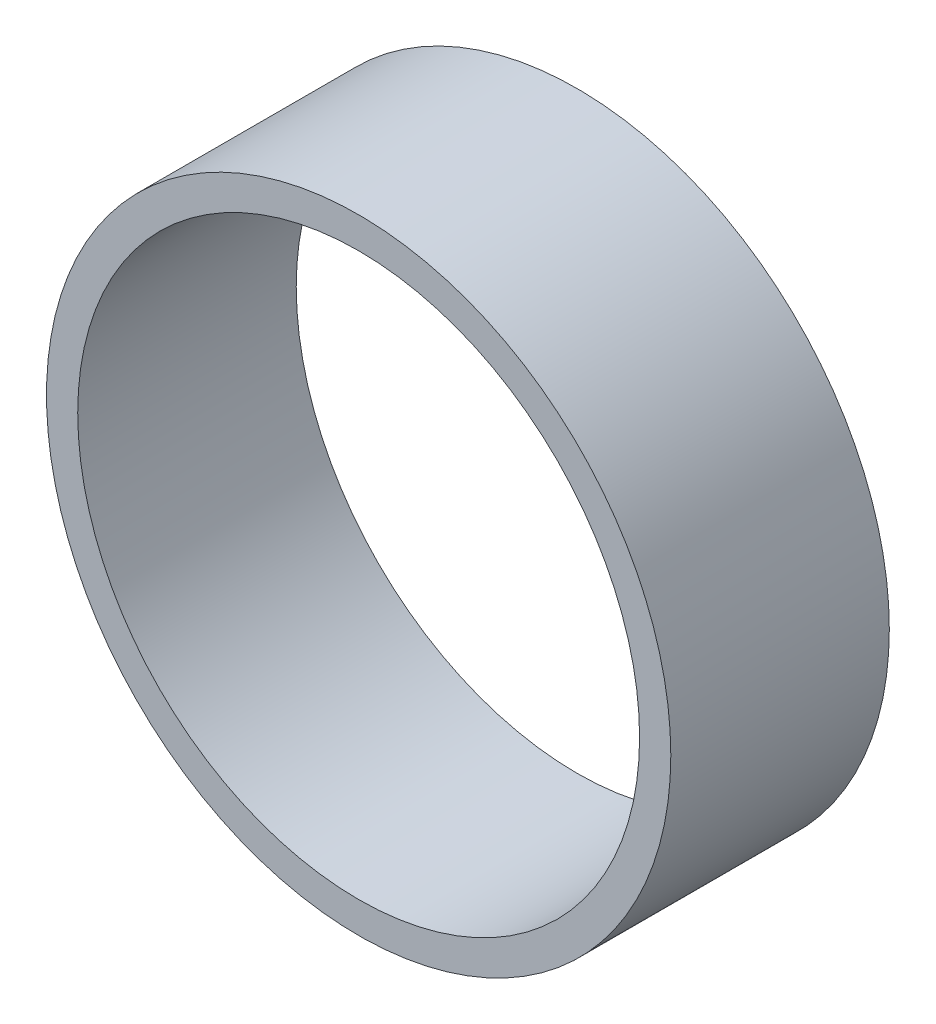
ISO-10303-21;
HEADER;
FILE_DESCRIPTION(('STEP AP214'),'2;1');
FILE_NAME('part.step','',(''),(''),'','','');
FILE_SCHEMA(('AUTOMOTIVE_DESIGN { 1 0 10303 214 1 1 1 1 }'));
ENDSEC;
DATA;
#1=APPLICATION_CONTEXT('core data for automotive mechanical design processes');
#2=APPLICATION_PROTOCOL_DEFINITION('international standard','automotive_design',2000,#1);
#3=PRODUCT_CONTEXT('',#1,'mechanical');
#4=PRODUCT('Part','Part','',(#3));
#5=PRODUCT_RELATED_PRODUCT_CATEGORY('part','',(#4));
#6=PRODUCT_DEFINITION_FORMATION('','',#4);
#7=PRODUCT_DEFINITION_CONTEXT('part definition',#1,'design');
#8=PRODUCT_DEFINITION('design','',#6,#7);
#9=PRODUCT_DEFINITION_SHAPE('','',#8);
#10=(LENGTH_UNIT() NAMED_UNIT(*) SI_UNIT(.MILLI.,.METRE.));
#11=(NAMED_UNIT(*) PLANE_ANGLE_UNIT() SI_UNIT($,.RADIAN.));
#12=(NAMED_UNIT(*) SI_UNIT($,.STERADIAN.) SOLID_ANGLE_UNIT());
#13=UNCERTAINTY_MEASURE_WITH_UNIT(LENGTH_MEASURE(1.E-05),#10,'distance_accuracy_value','');
#14=(GEOMETRIC_REPRESENTATION_CONTEXT(3) GLOBAL_UNCERTAINTY_ASSIGNED_CONTEXT((#13)) GLOBAL_UNIT_ASSIGNED_CONTEXT((#10,
#11,#12)) REPRESENTATION_CONTEXT('',''));
#15=CARTESIAN_POINT('',(0.,0.,0.));
#16=DIRECTION('',(0.,0.,1.));
#17=DIRECTION('',(1.,0.,0.));
#18=AXIS2_PLACEMENT_3D('',#15,#16,#17);
#19=CARTESIAN_POINT('',(0.,0.,7.));
#20=DIRECTION('',(0.,0.,1.));
#21=DIRECTION('',(1.,0.,0.));
#22=AXIS2_PLACEMENT_3D('',#19,#20,#21);
#23=PLANE('',#22);
#24=CARTESIAN_POINT('',(0.,0.,7.));
#25=DIRECTION('',(0.,0.,1.));
#26=DIRECTION('',(1.,0.,0.));
#27=AXIS2_PLACEMENT_3D('',#24,#25,#26);
#28=CIRCLE('',#27,10.);
#29=CARTESIAN_POINT('',(10.,0.,7.));
#30=VERTEX_POINT('',#29);
#31=EDGE_CURVE('E11',#30,#30,#28,.T.);
#32=ORIENTED_EDGE('',*,*,#31,.T.);
#33=EDGE_LOOP('',(#32));
#34=FACE_BOUND('',#33,.T.);
#35=CARTESIAN_POINT('',(0.,0.,7.));
#36=DIRECTION('',(0.,0.,1.));
#37=DIRECTION('',(1.,0.,0.));
#38=AXIS2_PLACEMENT_3D('',#35,#36,#37);
#39=CIRCLE('',#38,9.);
#40=CARTESIAN_POINT('',(9.,0.,7.));
#41=VERTEX_POINT('',#40);
#42=EDGE_CURVE('E49',#41,#41,#39,.T.);
#43=ORIENTED_EDGE('',*,*,#42,.F.);
#44=EDGE_LOOP('',(#43));
#45=FACE_BOUND('',#44,.T.);
#46=ADVANCED_FACE('F38',(#34,#45),#23,.T.);
#47=CARTESIAN_POINT('',(0.,0.,0.));
#48=DIRECTION('',(0.,0.,1.));
#49=DIRECTION('',(1.,0.,0.));
#50=AXIS2_PLACEMENT_3D('',#47,#48,#49);
#51=PLANE('',#50);
#52=CARTESIAN_POINT('',(0.,0.,0.));
#53=DIRECTION('',(0.,0.,1.));
#54=DIRECTION('',(1.,0.,0.));
#55=AXIS2_PLACEMENT_3D('',#52,#53,#54);
#56=CIRCLE('',#55,10.);
#57=CARTESIAN_POINT('',(10.,0.,0.));
#58=VERTEX_POINT('',#57);
#59=EDGE_CURVE('E42',#58,#58,#56,.T.);
#60=ORIENTED_EDGE('',*,*,#59,.F.);
#61=EDGE_LOOP('',(#60));
#62=FACE_BOUND('',#61,.T.);
#63=CARTESIAN_POINT('',(0.,0.,0.));
#64=DIRECTION('',(0.,0.,1.));
#65=DIRECTION('',(1.,0.,0.));
#66=AXIS2_PLACEMENT_3D('',#63,#64,#65);
#67=CIRCLE('',#66,9.);
#68=CARTESIAN_POINT('',(9.,0.,0.));
#69=VERTEX_POINT('',#68);
#70=EDGE_CURVE('E51',#69,#69,#67,.T.);
#71=ORIENTED_EDGE('',*,*,#70,.T.);
#72=EDGE_LOOP('',(#71));
#73=FACE_BOUND('',#72,.T.);
#74=ADVANCED_FACE('F61',(#62,#73),#51,.F.);
#75=CARTESIAN_POINT('',(0.,0.,7.));
#76=DIRECTION('',(0.,0.,-1.));
#77=DIRECTION('',(-1.,0.,0.));
#78=AXIS2_PLACEMENT_3D('',#75,#76,#77);
#79=CYLINDRICAL_SURFACE('',#78,10.);
#80=ORIENTED_EDGE('',*,*,#31,.F.);
#81=EDGE_LOOP('',(#80));
#82=FACE_BOUND('',#81,.T.);
#83=ORIENTED_EDGE('',*,*,#59,.T.);
#84=EDGE_LOOP('',(#83));
#85=FACE_BOUND('',#84,.T.);
#86=ADVANCED_FACE('F40',(#82,#85),#79,.T.);
#87=CARTESIAN_POINT('',(0.,0.,7.));
#88=DIRECTION('',(0.,0.,-1.));
#89=DIRECTION('',(-1.,0.,0.));
#90=AXIS2_PLACEMENT_3D('',#87,#88,#89);
#91=CYLINDRICAL_SURFACE('',#90,9.);
#92=ORIENTED_EDGE('',*,*,#42,.T.);
#93=EDGE_LOOP('',(#92));
#94=FACE_BOUND('',#93,.T.);
#95=ORIENTED_EDGE('',*,*,#70,.F.);
#96=EDGE_LOOP('',(#95));
#97=FACE_BOUND('',#96,.T.);
#98=ADVANCED_FACE('F57',(#94,#97),#91,.F.);
#99=CLOSED_SHELL('',(#46,#74,#86,#98));
#100=MANIFOLD_SOLID_BREP('B2',#99);
#101=ADVANCED_BREP_SHAPE_REPRESENTATION('',(#18,#100),#14);
#102=SHAPE_DEFINITION_REPRESENTATION(#9,#101);
ENDSEC;
END-ISO-10303-21;
